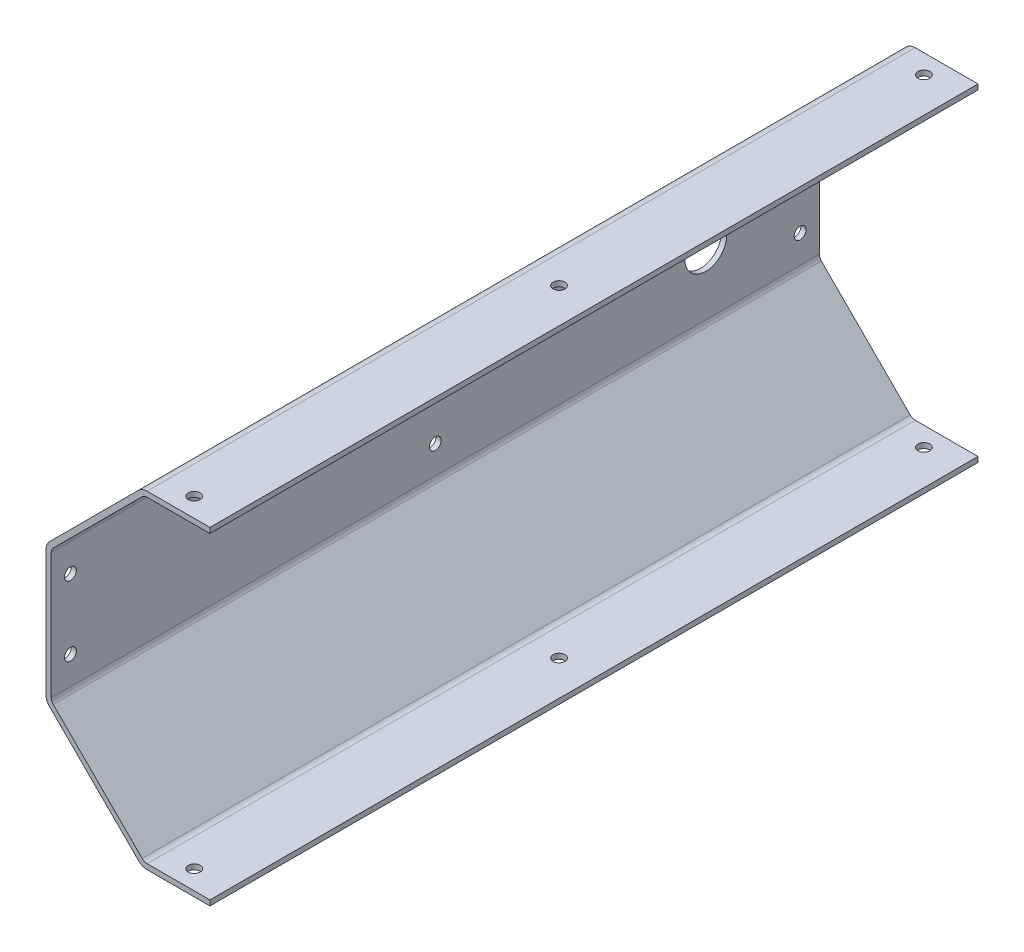
ISO-10303-21;
HEADER;
FILE_DESCRIPTION(('STEP AP214'),'2;1');
FILE_NAME('part.step','',(''),(''),'','','');
FILE_SCHEMA(('AUTOMOTIVE_DESIGN { 1 0 10303 214 1 1 1 1 }'));
ENDSEC;
DATA;
#1=APPLICATION_CONTEXT('core data for automotive mechanical design processes');
#2=APPLICATION_PROTOCOL_DEFINITION('international standard','automotive_design',2000,#1);
#3=PRODUCT_CONTEXT('',#1,'mechanical');
#4=PRODUCT('Part','Part','',(#3));
#5=PRODUCT_RELATED_PRODUCT_CATEGORY('part','',(#4));
#6=PRODUCT_DEFINITION_FORMATION('','',#4);
#7=PRODUCT_DEFINITION_CONTEXT('part definition',#1,'design');
#8=PRODUCT_DEFINITION('design','',#6,#7);
#9=PRODUCT_DEFINITION_SHAPE('','',#8);
#10=(LENGTH_UNIT() NAMED_UNIT(*) SI_UNIT(.MILLI.,.METRE.));
#11=(NAMED_UNIT(*) PLANE_ANGLE_UNIT() SI_UNIT($,.RADIAN.));
#12=(NAMED_UNIT(*) SI_UNIT($,.STERADIAN.) SOLID_ANGLE_UNIT());
#13=UNCERTAINTY_MEASURE_WITH_UNIT(LENGTH_MEASURE(1.E-05),#10,'distance_accuracy_value','');
#14=(GEOMETRIC_REPRESENTATION_CONTEXT(3) GLOBAL_UNCERTAINTY_ASSIGNED_CONTEXT((#13)) GLOBAL_UNIT_ASSIGNED_CONTEXT((#10,
#11,#12)) REPRESENTATION_CONTEXT('',''));
#15=CARTESIAN_POINT('',(0.,0.,0.));
#16=DIRECTION('',(0.,0.,1.));
#17=DIRECTION('',(1.,0.,0.));
#18=AXIS2_PLACEMENT_3D('',#15,#16,#17);
#19=CARTESIAN_POINT('',(-96.95,-17.9975792851109,-168.5));
#20=DIRECTION('',(1.,0.,0.));
#21=DIRECTION('',(0.,1.,0.));
#22=AXIS2_PLACEMENT_3D('',#19,#20,#21);
#23=PLANE('',#22);
#24=DIRECTION('',(0.,1.,0.));
#25=VECTOR('',#24,1.);
#26=CARTESIAN_POINT('',(-96.95,-17.9975792851109,51.5));
#27=LINE('',#26,#25);
#28=CARTESIAN_POINT('',(-96.95,-17.9975792851109,51.5));
#29=VERTEX_POINT('',#28);
#30=CARTESIAN_POINT('',(-96.95,17.9975792851113,51.5));
#31=VERTEX_POINT('',#30);
#32=EDGE_CURVE('E107',#29,#31,#27,.T.);
#33=ORIENTED_EDGE('',*,*,#32,.T.);
#34=DIRECTION('',(0.,0.,1.));
#35=VECTOR('',#34,1.);
#36=CARTESIAN_POINT('',(-96.95,17.9975792851113,-168.5));
#37=LINE('',#36,#35);
#38=CARTESIAN_POINT('',(-96.95,17.9975792851113,-168.5));
#39=VERTEX_POINT('',#38);
#40=EDGE_CURVE('E229',#39,#31,#37,.T.);
#41=ORIENTED_EDGE('',*,*,#40,.F.);
#42=DIRECTION('',(0.,1.,0.));
#43=VECTOR('',#42,1.);
#44=CARTESIAN_POINT('',(-96.95,-17.9975792851109,-168.5));
#45=LINE('',#44,#43);
#46=CARTESIAN_POINT('',(-96.95,-17.9975792851109,-168.5));
#47=VERTEX_POINT('',#46);
#48=EDGE_CURVE('E36',#47,#39,#45,.T.);
#49=ORIENTED_EDGE('',*,*,#48,.F.);
#50=DIRECTION('',(0.,0.,1.));
#51=VECTOR('',#50,1.);
#52=CARTESIAN_POINT('',(-96.95,-17.9975792851109,-168.5));
#53=LINE('',#52,#51);
#54=EDGE_CURVE('E180',#47,#29,#53,.T.);
#55=ORIENTED_EDGE('',*,*,#54,.T.);
#56=EDGE_LOOP('',(#33,#41,#49,#55));
#57=FACE_BOUND('',#56,.T.);
#58=CARTESIAN_POINT('',(-96.95,10.0000000000004,46.));
#59=DIRECTION('',(1.,0.,0.));
#60=DIRECTION('',(0.,-1.,0.));
#61=AXIS2_PLACEMENT_3D('',#58,#59,#60);
#62=CIRCLE('',#61,1.7);
#63=CARTESIAN_POINT('',(-96.95,8.30000000000044,46.));
#64=VERTEX_POINT('',#63);
#65=EDGE_CURVE('E297',#64,#64,#62,.T.);
#66=ORIENTED_EDGE('',*,*,#65,.T.);
#67=EDGE_LOOP('',(#66));
#68=FACE_BOUND('',#67,.T.);
#69=CARTESIAN_POINT('',(-96.95,10.0000000000004,-58.5));
#70=DIRECTION('',(1.,0.,0.));
#71=DIRECTION('',(0.,-1.,0.));
#72=AXIS2_PLACEMENT_3D('',#69,#70,#71);
#73=CIRCLE('',#72,1.7);
#74=CARTESIAN_POINT('',(-96.95,8.30000000000044,-58.5));
#75=VERTEX_POINT('',#74);
#76=EDGE_CURVE('E857',#75,#75,#73,.T.);
#77=ORIENTED_EDGE('',*,*,#76,.T.);
#78=EDGE_LOOP('',(#77));
#79=FACE_BOUND('',#78,.T.);
#80=CARTESIAN_POINT('',(-96.95,10.0000000000004,-163.));
#81=DIRECTION('',(1.,0.,0.));
#82=DIRECTION('',(0.,-1.,0.));
#83=AXIS2_PLACEMENT_3D('',#80,#81,#82);
#84=CIRCLE('',#83,1.7);
#85=CARTESIAN_POINT('',(-96.95,8.30000000000044,-163.));
#86=VERTEX_POINT('',#85);
#87=EDGE_CURVE('E851',#86,#86,#84,.T.);
#88=ORIENTED_EDGE('',*,*,#87,.T.);
#89=EDGE_LOOP('',(#88));
#90=FACE_BOUND('',#89,.T.);
#91=CARTESIAN_POINT('',(-96.95,-9.99999999999955,46.));
#92=DIRECTION('',(1.,0.,0.));
#93=DIRECTION('',(0.,-1.,0.));
#94=AXIS2_PLACEMENT_3D('',#91,#92,#93);
#95=CIRCLE('',#94,1.7);
#96=CARTESIAN_POINT('',(-96.95,-11.6999999999995,46.));
#97=VERTEX_POINT('',#96);
#98=EDGE_CURVE('E845',#97,#97,#95,.T.);
#99=ORIENTED_EDGE('',*,*,#98,.T.);
#100=EDGE_LOOP('',(#99));
#101=FACE_BOUND('',#100,.T.);
#102=CARTESIAN_POINT('',(-96.95,-9.99999999999955,-58.5));
#103=DIRECTION('',(1.,0.,0.));
#104=DIRECTION('',(0.,-1.,0.));
#105=AXIS2_PLACEMENT_3D('',#102,#103,#104);
#106=CIRCLE('',#105,1.7);
#107=CARTESIAN_POINT('',(-96.95,-11.6999999999995,-58.5));
#108=VERTEX_POINT('',#107);
#109=EDGE_CURVE('E840',#108,#108,#106,.T.);
#110=ORIENTED_EDGE('',*,*,#109,.T.);
#111=EDGE_LOOP('',(#110));
#112=FACE_BOUND('',#111,.T.);
#113=CARTESIAN_POINT('',(-96.95,-9.99999999999956,-163.));
#114=DIRECTION('',(1.,0.,0.));
#115=DIRECTION('',(0.,-1.,0.));
#116=AXIS2_PLACEMENT_3D('',#113,#114,#115);
#117=CIRCLE('',#116,1.7);
#118=CARTESIAN_POINT('',(-96.95,-11.6999999999996,-163.));
#119=VERTEX_POINT('',#118);
#120=EDGE_CURVE('E833',#119,#119,#117,.T.);
#121=ORIENTED_EDGE('',*,*,#120,.T.);
#122=EDGE_LOOP('',(#121));
#123=FACE_BOUND('',#122,.T.);
#124=CARTESIAN_POINT('',(-96.95,-4.67430235906452E-05,-135.980047718646));
#125=DIRECTION('',(-1.,0.,0.));
#126=DIRECTION('',(0.,1.,0.));
#127=AXIS2_PLACEMENT_3D('',#124,#125,#126);
#128=CIRCLE('',#127,6.);
#129=CARTESIAN_POINT('',(-96.95,5.99995325697641,-135.980047718646));
#130=VERTEX_POINT('',#129);
#131=EDGE_CURVE('E830',#130,#130,#128,.T.);
#132=ORIENTED_EDGE('',*,*,#131,.F.);
#133=EDGE_LOOP('',(#132));
#134=FACE_BOUND('',#133,.T.);
#135=ADVANCED_FACE('F17',(#57,#68,#79,#90,#101,#112,#123,#134),#23,.F.);
#136=CARTESIAN_POINT('',(-95.45,17.9975792851112,-168.5));
#137=DIRECTION('',(-1.,0.,0.));
#138=DIRECTION('',(0.,-1.,0.));
#139=AXIS2_PLACEMENT_3D('',#136,#137,#138);
#140=PLANE('',#139);
#141=CARTESIAN_POINT('',(-95.45,-4.67430235906452E-05,-135.980047718646));
#142=DIRECTION('',(-1.,0.,0.));
#143=DIRECTION('',(0.,-1.,0.));
#144=AXIS2_PLACEMENT_3D('',#141,#142,#143);
#145=CIRCLE('',#144,6.);
#146=CARTESIAN_POINT('',(-95.45,-6.00004674302359,-135.980047718646));
#147=VERTEX_POINT('',#146);
#148=EDGE_CURVE('E21',#147,#147,#145,.T.);
#149=ORIENTED_EDGE('',*,*,#148,.T.);
#150=EDGE_LOOP('',(#149));
#151=FACE_BOUND('',#150,.T.);
#152=CARTESIAN_POINT('',(-95.45,-9.99999999999955,-58.5));
#153=DIRECTION('',(1.,0.,0.));
#154=DIRECTION('',(0.,-1.,0.));
#155=AXIS2_PLACEMENT_3D('',#152,#153,#154);
#156=CIRCLE('',#155,1.7);
#157=CARTESIAN_POINT('',(-95.45,-11.6999999999995,-58.5));
#158=VERTEX_POINT('',#157);
#159=EDGE_CURVE('E842',#158,#158,#156,.T.);
#160=ORIENTED_EDGE('',*,*,#159,.F.);
#161=EDGE_LOOP('',(#160));
#162=FACE_BOUND('',#161,.T.);
#163=CARTESIAN_POINT('',(-95.45,10.0000000000004,-163.));
#164=DIRECTION('',(1.,0.,0.));
#165=DIRECTION('',(0.,-1.,0.));
#166=AXIS2_PLACEMENT_3D('',#163,#164,#165);
#167=CIRCLE('',#166,1.7);
#168=CARTESIAN_POINT('',(-95.45,8.30000000000044,-163.));
#169=VERTEX_POINT('',#168);
#170=EDGE_CURVE('E854',#169,#169,#167,.T.);
#171=ORIENTED_EDGE('',*,*,#170,.F.);
#172=EDGE_LOOP('',(#171));
#173=FACE_BOUND('',#172,.T.);
#174=CARTESIAN_POINT('',(-95.45,10.0000000000004,46.));
#175=DIRECTION('',(1.,0.,0.));
#176=DIRECTION('',(0.,-1.,0.));
#177=AXIS2_PLACEMENT_3D('',#174,#175,#176);
#178=CIRCLE('',#177,1.7);
#179=CARTESIAN_POINT('',(-95.45,8.30000000000044,46.));
#180=VERTEX_POINT('',#179);
#181=EDGE_CURVE('E292',#180,#180,#178,.T.);
#182=ORIENTED_EDGE('',*,*,#181,.F.);
#183=EDGE_LOOP('',(#182));
#184=FACE_BOUND('',#183,.T.);
#185=DIRECTION('',(0.,-1.,0.));
#186=VECTOR('',#185,1.);
#187=CARTESIAN_POINT('',(-95.45,17.9975792851112,51.5));
#188=LINE('',#187,#186);
#189=CARTESIAN_POINT('',(-95.45,17.9975792851113,51.5));
#190=VERTEX_POINT('',#189);
#191=CARTESIAN_POINT('',(-95.45,-17.9975792851109,51.5));
#192=VERTEX_POINT('',#191);
#193=EDGE_CURVE('E207',#190,#192,#188,.T.);
#194=ORIENTED_EDGE('',*,*,#193,.T.);
#195=DIRECTION('',(0.,0.,1.));
#196=VECTOR('',#195,1.);
#197=CARTESIAN_POINT('',(-95.45,-17.9975792851109,-168.5));
#198=LINE('',#197,#196);
#199=CARTESIAN_POINT('',(-95.45,-17.9975792851109,-168.5));
#200=VERTEX_POINT('',#199);
#201=EDGE_CURVE('E251',#200,#192,#198,.T.);
#202=ORIENTED_EDGE('',*,*,#201,.F.);
#203=DIRECTION('',(0.,-1.,0.));
#204=VECTOR('',#203,1.);
#205=CARTESIAN_POINT('',(-95.45,17.9975792851112,-168.5));
#206=LINE('',#205,#204);
#207=CARTESIAN_POINT('',(-95.45,17.9975792851113,-168.5));
#208=VERTEX_POINT('',#207);
#209=EDGE_CURVE('E334',#208,#200,#206,.T.);
#210=ORIENTED_EDGE('',*,*,#209,.F.);
#211=DIRECTION('',(0.,0.,1.));
#212=VECTOR('',#211,1.);
#213=CARTESIAN_POINT('',(-95.45,17.9975792851113,-168.5));
#214=LINE('',#213,#212);
#215=EDGE_CURVE('E254',#208,#190,#214,.T.);
#216=ORIENTED_EDGE('',*,*,#215,.T.);
#217=EDGE_LOOP('',(#194,#202,#210,#216));
#218=FACE_BOUND('',#217,.T.);
#219=CARTESIAN_POINT('',(-95.45,10.0000000000004,-58.5));
#220=DIRECTION('',(1.,0.,0.));
#221=DIRECTION('',(0.,-1.,0.));
#222=AXIS2_PLACEMENT_3D('',#219,#220,#221);
#223=CIRCLE('',#222,1.7);
#224=CARTESIAN_POINT('',(-95.45,8.30000000000044,-58.5));
#225=VERTEX_POINT('',#224);
#226=EDGE_CURVE('E860',#225,#225,#223,.T.);
#227=ORIENTED_EDGE('',*,*,#226,.F.);
#228=EDGE_LOOP('',(#227));
#229=FACE_BOUND('',#228,.T.);
#230=CARTESIAN_POINT('',(-95.45,-9.99999999999955,46.));
#231=DIRECTION('',(1.,0.,0.));
#232=DIRECTION('',(0.,-1.,0.));
#233=AXIS2_PLACEMENT_3D('',#230,#231,#232);
#234=CIRCLE('',#233,1.7);
#235=CARTESIAN_POINT('',(-95.45,-11.6999999999995,46.));
#236=VERTEX_POINT('',#235);
#237=EDGE_CURVE('E848',#236,#236,#234,.T.);
#238=ORIENTED_EDGE('',*,*,#237,.F.);
#239=EDGE_LOOP('',(#238));
#240=FACE_BOUND('',#239,.T.);
#241=CARTESIAN_POINT('',(-95.45,-9.99999999999956,-163.));
#242=DIRECTION('',(1.,0.,0.));
#243=DIRECTION('',(0.,-1.,0.));
#244=AXIS2_PLACEMENT_3D('',#241,#242,#243);
#245=CIRCLE('',#244,1.7);
#246=CARTESIAN_POINT('',(-95.45,-11.6999999999996,-163.));
#247=VERTEX_POINT('',#246);
#248=EDGE_CURVE('E835',#247,#247,#245,.T.);
#249=ORIENTED_EDGE('',*,*,#248,.F.);
#250=EDGE_LOOP('',(#249));
#251=FACE_BOUND('',#250,.T.);
#252=ADVANCED_FACE('F403',(#151,#162,#173,#184,#218,#229,#240,#251),#140,.F.);
#253=CARTESIAN_POINT('',(-95.9248737341529,20.4724530192641,-168.5));
#254=DIRECTION('',(0.707106781186543,-0.707106781186553,0.));
#255=DIRECTION('',(0.707106781186553,0.707106781186543,0.));
#256=AXIS2_PLACEMENT_3D('',#253,#254,#255);
#257=PLANE('',#256);
#258=DIRECTION('',(0.707106781186553,0.707106781186543,0.));
#259=VECTOR('',#258,1.);
#260=CARTESIAN_POINT('',(-95.9248737341529,20.4724530192641,51.5));
#261=LINE('',#260,#259);
#262=CARTESIAN_POINT('',(-95.9248737341529,20.4724530192641,51.5));
#263=VERTEX_POINT('',#262);
#264=CARTESIAN_POINT('',(-70.4724530192636,45.9248737341531,51.5));
#265=VERTEX_POINT('',#264);
#266=EDGE_CURVE('E189',#263,#265,#261,.T.);
#267=ORIENTED_EDGE('',*,*,#266,.T.);
#268=DIRECTION('',(0.,0.,1.));
#269=VECTOR('',#268,1.);
#270=CARTESIAN_POINT('',(-70.4724530192636,45.9248737341531,-168.5));
#271=LINE('',#270,#269);
#272=CARTESIAN_POINT('',(-70.4724530192636,45.9248737341531,-168.5));
#273=VERTEX_POINT('',#272);
#274=EDGE_CURVE('E11',#273,#265,#271,.T.);
#275=ORIENTED_EDGE('',*,*,#274,.F.);
#276=DIRECTION('',(0.707106781186553,0.707106781186543,0.));
#277=VECTOR('',#276,1.);
#278=CARTESIAN_POINT('',(-95.9248737341529,20.4724530192641,-168.5));
#279=LINE('',#278,#277);
#280=CARTESIAN_POINT('',(-95.9248737341529,20.4724530192641,-168.5));
#281=VERTEX_POINT('',#280);
#282=EDGE_CURVE('E228',#281,#273,#279,.T.);
#283=ORIENTED_EDGE('',*,*,#282,.F.);
#284=DIRECTION('',(0.,0.,1.));
#285=VECTOR('',#284,1.);
#286=CARTESIAN_POINT('',(-95.9248737341529,20.4724530192641,-168.5));
#287=LINE('',#286,#285);
#288=EDGE_CURVE('E188',#281,#263,#287,.T.);
#289=ORIENTED_EDGE('',*,*,#288,.T.);
#290=EDGE_LOOP('',(#267,#275,#283,#289));
#291=FACE_BOUND('',#290,.T.);
#292=ADVANCED_FACE('F19',(#291),#257,.F.);
#293=CARTESIAN_POINT('',(-67.9975792851107,43.45,-168.5));
#294=DIRECTION('',(0.,0.,1.));
#295=DIRECTION('',(1.,0.,0.));
#296=AXIS2_PLACEMENT_3D('',#293,#294,#295);
#297=CYLINDRICAL_SURFACE('',#296,3.5);
#298=CARTESIAN_POINT('',(-67.9975792851107,43.45,51.5));
#299=DIRECTION('',(0.,0.,-1.));
#300=DIRECTION('',(1.,0.,0.));
#301=AXIS2_PLACEMENT_3D('',#298,#299,#300);
#302=CIRCLE('',#301,3.5);
#303=CARTESIAN_POINT('',(-67.9975792851107,46.95,51.5));
#304=VERTEX_POINT('',#303);
#305=EDGE_CURVE('E192',#265,#304,#302,.T.);
#306=ORIENTED_EDGE('',*,*,#305,.T.);
#307=DIRECTION('',(0.,0.,1.));
#308=VECTOR('',#307,1.);
#309=CARTESIAN_POINT('',(-67.9975792851107,46.95,-168.5));
#310=LINE('',#309,#308);
#311=CARTESIAN_POINT('',(-67.9975792851107,46.95,-168.5));
#312=VERTEX_POINT('',#311);
#313=EDGE_CURVE('E27',#312,#304,#310,.T.);
#314=ORIENTED_EDGE('',*,*,#313,.F.);
#315=CARTESIAN_POINT('',(-67.9975792851107,43.45,-168.5));
#316=DIRECTION('',(0.,0.,-1.));
#317=DIRECTION('',(1.,0.,0.));
#318=AXIS2_PLACEMENT_3D('',#315,#316,#317);
#319=CIRCLE('',#318,3.5);
#320=EDGE_CURVE('E320',#273,#312,#319,.T.);
#321=ORIENTED_EDGE('',*,*,#320,.F.);
#322=ORIENTED_EDGE('',*,*,#274,.T.);
#323=EDGE_LOOP('',(#306,#314,#321,#322));
#324=FACE_BOUND('',#323,.T.);
#325=ADVANCED_FACE('F370',(#324),#297,.T.);
#326=CARTESIAN_POINT('',(-67.9975792851107,46.95,-168.5));
#327=DIRECTION('',(0.,-1.,0.));
#328=DIRECTION('',(1.,0.,0.));
#329=AXIS2_PLACEMENT_3D('',#326,#327,#328);
#330=PLANE('',#329);
#331=CARTESIAN_POINT('',(-59.9999999999969,46.95,46.));
#332=DIRECTION('',(0.,-1.,0.));
#333=DIRECTION('',(1.,0.,0.));
#334=AXIS2_PLACEMENT_3D('',#331,#332,#333);
#335=CIRCLE('',#334,1.7);
#336=CARTESIAN_POINT('',(-58.2999999999969,46.95,46.));
#337=VERTEX_POINT('',#336);
#338=EDGE_CURVE('E286',#337,#337,#335,.T.);
#339=ORIENTED_EDGE('',*,*,#338,.T.);
#340=EDGE_LOOP('',(#339));
#341=FACE_BOUND('',#340,.T.);
#342=CARTESIAN_POINT('',(-59.9999999999968,46.95,-58.5));
#343=DIRECTION('',(0.,-1.,0.));
#344=DIRECTION('',(1.,0.,0.));
#345=AXIS2_PLACEMENT_3D('',#342,#343,#344);
#346=CIRCLE('',#345,1.7);
#347=CARTESIAN_POINT('',(-58.2999999999968,46.95,-58.5));
#348=VERTEX_POINT('',#347);
#349=EDGE_CURVE('E283',#348,#348,#346,.T.);
#350=ORIENTED_EDGE('',*,*,#349,.T.);
#351=EDGE_LOOP('',(#350));
#352=FACE_BOUND('',#351,.T.);
#353=CARTESIAN_POINT('',(-59.9999999999969,46.95,-163.));
#354=DIRECTION('',(0.,-1.,0.));
#355=DIRECTION('',(1.,0.,0.));
#356=AXIS2_PLACEMENT_3D('',#353,#354,#355);
#357=CIRCLE('',#356,1.7);
#358=CARTESIAN_POINT('',(-58.2999999999969,46.95,-163.));
#359=VERTEX_POINT('',#358);
#360=EDGE_CURVE('E280',#359,#359,#357,.T.);
#361=ORIENTED_EDGE('',*,*,#360,.T.);
#362=EDGE_LOOP('',(#361));
#363=FACE_BOUND('',#362,.T.);
#364=DIRECTION('',(1.,0.,0.));
#365=VECTOR('',#364,1.);
#366=CARTESIAN_POINT('',(-67.9975792851107,46.95,51.5));
#367=LINE('',#366,#365);
#368=CARTESIAN_POINT('',(-50.,46.95,51.5));
#369=VERTEX_POINT('',#368);
#370=EDGE_CURVE('E195',#304,#369,#367,.T.);
#371=ORIENTED_EDGE('',*,*,#370,.T.);
#372=DIRECTION('',(0.,0.,1.));
#373=VECTOR('',#372,1.);
#374=CARTESIAN_POINT('',(-50.,46.95,-168.5));
#375=LINE('',#374,#373);
#376=CARTESIAN_POINT('',(-50.,46.95,-168.5));
#377=VERTEX_POINT('',#376);
#378=EDGE_CURVE('E269',#377,#369,#375,.T.);
#379=ORIENTED_EDGE('',*,*,#378,.F.);
#380=DIRECTION('',(1.,0.,0.));
#381=VECTOR('',#380,1.);
#382=CARTESIAN_POINT('',(-67.9975792851107,46.95,-168.5));
#383=LINE('',#382,#381);
#384=EDGE_CURVE('E322',#312,#377,#383,.T.);
#385=ORIENTED_EDGE('',*,*,#384,.F.);
#386=ORIENTED_EDGE('',*,*,#313,.T.);
#387=EDGE_LOOP('',(#371,#379,#385,#386));
#388=FACE_BOUND('',#387,.T.);
#389=ADVANCED_FACE('F373',(#341,#352,#363,#388),#330,.F.);
#390=CARTESIAN_POINT('',(-50.,46.95,-168.5));
#391=DIRECTION('',(-1.,0.,0.));
#392=DIRECTION('',(0.,0.,1.));
#393=AXIS2_PLACEMENT_3D('',#390,#391,#392);
#394=PLANE('',#393);
#395=DIRECTION('',(0.,-1.,0.));
#396=VECTOR('',#395,1.);
#397=CARTESIAN_POINT('',(-50.,46.95,51.5));
#398=LINE('',#397,#396);
#399=CARTESIAN_POINT('',(-50.,45.45,51.5));
#400=VERTEX_POINT('',#399);
#401=EDGE_CURVE('E197',#369,#400,#398,.T.);
#402=ORIENTED_EDGE('',*,*,#401,.T.);
#403=DIRECTION('',(0.,0.,1.));
#404=VECTOR('',#403,1.);
#405=CARTESIAN_POINT('',(-50.,45.45,-168.5));
#406=LINE('',#405,#404);
#407=CARTESIAN_POINT('',(-50.,45.45,-168.5));
#408=VERTEX_POINT('',#407);
#409=EDGE_CURVE('E266',#408,#400,#406,.T.);
#410=ORIENTED_EDGE('',*,*,#409,.F.);
#411=DIRECTION('',(0.,-1.,0.));
#412=VECTOR('',#411,1.);
#413=CARTESIAN_POINT('',(-50.,46.95,-168.5));
#414=LINE('',#413,#412);
#415=EDGE_CURVE('E324',#377,#408,#414,.T.);
#416=ORIENTED_EDGE('',*,*,#415,.F.);
#417=ORIENTED_EDGE('',*,*,#378,.T.);
#418=EDGE_LOOP('',(#402,#410,#416,#417));
#419=FACE_BOUND('',#418,.T.);
#420=ADVANCED_FACE('F378',(#419),#394,.F.);
#421=CARTESIAN_POINT('',(-50.,45.45,-168.5));
#422=DIRECTION('',(0.,1.,0.));
#423=DIRECTION('',(-1.,0.,0.));
#424=AXIS2_PLACEMENT_3D('',#421,#422,#423);
#425=PLANE('',#424);
#426=CARTESIAN_POINT('',(-59.9999999999969,45.45,46.));
#427=DIRECTION('',(0.,1.,0.));
#428=DIRECTION('',(-1.,0.,0.));
#429=AXIS2_PLACEMENT_3D('',#426,#427,#428);
#430=CIRCLE('',#429,1.7);
#431=CARTESIAN_POINT('',(-61.6999999999969,45.45,46.));
#432=VERTEX_POINT('',#431);
#433=EDGE_CURVE('E284',#432,#432,#430,.T.);
#434=ORIENTED_EDGE('',*,*,#433,.T.);
#435=EDGE_LOOP('',(#434));
#436=FACE_BOUND('',#435,.T.);
#437=CARTESIAN_POINT('',(-59.9999999999969,45.45,-58.5));
#438=DIRECTION('',(0.,1.,0.));
#439=DIRECTION('',(-1.,0.,0.));
#440=AXIS2_PLACEMENT_3D('',#437,#438,#439);
#441=CIRCLE('',#440,1.7);
#442=CARTESIAN_POINT('',(-61.6999999999969,45.45,-58.5));
#443=VERTEX_POINT('',#442);
#444=EDGE_CURVE('E281',#443,#443,#441,.T.);
#445=ORIENTED_EDGE('',*,*,#444,.T.);
#446=EDGE_LOOP('',(#445));
#447=FACE_BOUND('',#446,.T.);
#448=CARTESIAN_POINT('',(-59.9999999999969,45.45,-163.));
#449=DIRECTION('',(0.,1.,0.));
#450=DIRECTION('',(-1.,0.,0.));
#451=AXIS2_PLACEMENT_3D('',#448,#449,#450);
#452=CIRCLE('',#451,1.7);
#453=CARTESIAN_POINT('',(-61.6999999999969,45.45,-163.));
#454=VERTEX_POINT('',#453);
#455=EDGE_CURVE('E276',#454,#454,#452,.T.);
#456=ORIENTED_EDGE('',*,*,#455,.T.);
#457=EDGE_LOOP('',(#456));
#458=FACE_BOUND('',#457,.T.);
#459=DIRECTION('',(-1.,0.,0.));
#460=VECTOR('',#459,1.);
#461=CARTESIAN_POINT('',(-50.,45.45,51.5));
#462=LINE('',#461,#460);
#463=CARTESIAN_POINT('',(-67.9975792851107,45.45,51.5));
#464=VERTEX_POINT('',#463);
#465=EDGE_CURVE('E199',#400,#464,#462,.T.);
#466=ORIENTED_EDGE('',*,*,#465,.T.);
#467=DIRECTION('',(0.,0.,1.));
#468=VECTOR('',#467,1.);
#469=CARTESIAN_POINT('',(-67.9975792851107,45.45,-168.5));
#470=LINE('',#469,#468);
#471=CARTESIAN_POINT('',(-67.9975792851107,45.45,-168.5));
#472=VERTEX_POINT('',#471);
#473=EDGE_CURVE('E263',#472,#464,#470,.T.);
#474=ORIENTED_EDGE('',*,*,#473,.F.);
#475=DIRECTION('',(-1.,0.,0.));
#476=VECTOR('',#475,1.);
#477=CARTESIAN_POINT('',(-50.,45.45,-168.5));
#478=LINE('',#477,#476);
#479=EDGE_CURVE('E326',#408,#472,#478,.T.);
#480=ORIENTED_EDGE('',*,*,#479,.F.);
#481=ORIENTED_EDGE('',*,*,#409,.T.);
#482=EDGE_LOOP('',(#466,#474,#480,#481));
#483=FACE_BOUND('',#482,.T.);
#484=ADVANCED_FACE('F384',(#436,#447,#458,#483),#425,.F.);
#485=CARTESIAN_POINT('',(-67.9975792851107,43.45,-168.5));
#486=DIRECTION('',(0.,0.,1.));
#487=DIRECTION('',(1.,0.,0.));
#488=AXIS2_PLACEMENT_3D('',#485,#486,#487);
#489=CYLINDRICAL_SURFACE('',#488,2.);
#490=CARTESIAN_POINT('',(-67.9975792851107,43.45,51.5));
#491=DIRECTION('',(0.,0.,1.));
#492=DIRECTION('',(1.,0.,0.));
#493=AXIS2_PLACEMENT_3D('',#490,#491,#492);
#494=CIRCLE('',#493,2.);
#495=CARTESIAN_POINT('',(-69.4117928474838,44.8642135623733,51.5));
#496=VERTEX_POINT('',#495);
#497=EDGE_CURVE('E201',#464,#496,#494,.T.);
#498=ORIENTED_EDGE('',*,*,#497,.T.);
#499=DIRECTION('',(0.,0.,1.));
#500=VECTOR('',#499,1.);
#501=CARTESIAN_POINT('',(-69.4117928474838,44.8642135623733,-168.5));
#502=LINE('',#501,#500);
#503=CARTESIAN_POINT('',(-69.4117928474838,44.8642135623733,-168.5));
#504=VERTEX_POINT('',#503);
#505=EDGE_CURVE('E260',#504,#496,#502,.T.);
#506=ORIENTED_EDGE('',*,*,#505,.F.);
#507=CARTESIAN_POINT('',(-67.9975792851107,43.45,-168.5));
#508=DIRECTION('',(0.,0.,1.));
#509=DIRECTION('',(1.,0.,0.));
#510=AXIS2_PLACEMENT_3D('',#507,#508,#509);
#511=CIRCLE('',#510,2.);
#512=EDGE_CURVE('E328',#472,#504,#511,.T.);
#513=ORIENTED_EDGE('',*,*,#512,.F.);
#514=ORIENTED_EDGE('',*,*,#473,.T.);
#515=EDGE_LOOP('',(#498,#506,#513,#514));
#516=FACE_BOUND('',#515,.T.);
#517=ADVANCED_FACE('F388',(#516),#489,.F.);
#518=CARTESIAN_POINT('',(-69.4117928474838,44.8642135623733,-168.5));
#519=DIRECTION('',(-0.707106781186543,0.707106781186553,0.));
#520=DIRECTION('',(-0.707106781186553,-0.707106781186543,0.));
#521=AXIS2_PLACEMENT_3D('',#518,#519,#520);
#522=PLANE('',#521);
#523=DIRECTION('',(-0.707106781186553,-0.707106781186543,0.));
#524=VECTOR('',#523,1.);
#525=CARTESIAN_POINT('',(-69.4117928474838,44.8642135623733,51.5));
#526=LINE('',#525,#524);
#527=CARTESIAN_POINT('',(-94.864213562373,19.4117928474843,51.5));
#528=VERTEX_POINT('',#527);
#529=EDGE_CURVE('E203',#496,#528,#526,.T.);
#530=ORIENTED_EDGE('',*,*,#529,.T.);
#531=DIRECTION('',(0.,0.,1.));
#532=VECTOR('',#531,1.);
#533=CARTESIAN_POINT('',(-94.864213562373,19.4117928474843,-168.5));
#534=LINE('',#533,#532);
#535=CARTESIAN_POINT('',(-94.864213562373,19.4117928474843,-168.5));
#536=VERTEX_POINT('',#535);
#537=EDGE_CURVE('E257',#536,#528,#534,.T.);
#538=ORIENTED_EDGE('',*,*,#537,.F.);
#539=DIRECTION('',(-0.707106781186553,-0.707106781186543,0.));
#540=VECTOR('',#539,1.);
#541=CARTESIAN_POINT('',(-69.4117928474838,44.8642135623733,-168.5));
#542=LINE('',#541,#540);
#543=EDGE_CURVE('E330',#504,#536,#542,.T.);
#544=ORIENTED_EDGE('',*,*,#543,.F.);
#545=ORIENTED_EDGE('',*,*,#505,.T.);
#546=EDGE_LOOP('',(#530,#538,#544,#545));
#547=FACE_BOUND('',#546,.T.);
#548=ADVANCED_FACE('F393',(#547),#522,.F.);
#549=CARTESIAN_POINT('',(-93.45,17.9975792851112,-168.5));
#550=DIRECTION('',(0.,0.,1.));
#551=DIRECTION('',(1.,0.,0.));
#552=AXIS2_PLACEMENT_3D('',#549,#550,#551);
#553=CYLINDRICAL_SURFACE('',#552,2.);
#554=CARTESIAN_POINT('',(-93.45,17.9975792851112,51.5));
#555=DIRECTION('',(0.,0.,1.));
#556=DIRECTION('',(1.,0.,0.));
#557=AXIS2_PLACEMENT_3D('',#554,#555,#556);
#558=CIRCLE('',#557,2.);
#559=EDGE_CURVE('E205',#528,#190,#558,.T.);
#560=ORIENTED_EDGE('',*,*,#559,.T.);
#561=ORIENTED_EDGE('',*,*,#215,.F.);
#562=CARTESIAN_POINT('',(-93.45,17.9975792851112,-168.5));
#563=DIRECTION('',(0.,0.,1.));
#564=DIRECTION('',(1.,0.,0.));
#565=AXIS2_PLACEMENT_3D('',#562,#563,#564);
#566=CIRCLE('',#565,2.);
#567=EDGE_CURVE('E332',#536,#208,#566,.T.);
#568=ORIENTED_EDGE('',*,*,#567,.F.);
#569=ORIENTED_EDGE('',*,*,#537,.T.);
#570=EDGE_LOOP('',(#560,#561,#568,#569));
#571=FACE_BOUND('',#570,.T.);
#572=ADVANCED_FACE('F399',(#571),#553,.F.);
#573=CARTESIAN_POINT('',(-93.45,-17.9975792851109,-168.5));
#574=DIRECTION('',(0.,0.,1.));
#575=DIRECTION('',(1.,0.,0.));
#576=AXIS2_PLACEMENT_3D('',#573,#574,#575);
#577=CYLINDRICAL_SURFACE('',#576,2.);
#578=CARTESIAN_POINT('',(-93.45,-17.9975792851109,51.5));
#579=DIRECTION('',(0.,0.,1.));
#580=DIRECTION('',(1.,0.,0.));
#581=AXIS2_PLACEMENT_3D('',#578,#579,#580);
#582=CIRCLE('',#581,2.);
#583=CARTESIAN_POINT('',(-94.8642135623731,-19.411792847484,51.5));
#584=VERTEX_POINT('',#583);
#585=EDGE_CURVE('E209',#192,#584,#582,.T.);
#586=ORIENTED_EDGE('',*,*,#585,.T.);
#587=DIRECTION('',(0.,0.,1.));
#588=VECTOR('',#587,1.);
#589=CARTESIAN_POINT('',(-94.8642135623731,-19.411792847484,-168.5));
#590=LINE('',#589,#588);
#591=CARTESIAN_POINT('',(-94.8642135623731,-19.411792847484,-168.5));
#592=VERTEX_POINT('',#591);
#593=EDGE_CURVE('E248',#592,#584,#590,.T.);
#594=ORIENTED_EDGE('',*,*,#593,.F.);
#595=CARTESIAN_POINT('',(-93.45,-17.9975792851109,-168.5));
#596=DIRECTION('',(0.,0.,1.));
#597=DIRECTION('',(1.,0.,0.));
#598=AXIS2_PLACEMENT_3D('',#595,#596,#597);
#599=CIRCLE('',#598,2.);
#600=EDGE_CURVE('E336',#200,#592,#599,.T.);
#601=ORIENTED_EDGE('',*,*,#600,.F.);
#602=ORIENTED_EDGE('',*,*,#201,.T.);
#603=EDGE_LOOP('',(#586,#594,#601,#602));
#604=FACE_BOUND('',#603,.T.);
#605=ADVANCED_FACE('F409',(#604),#577,.F.);
#606=CARTESIAN_POINT('',(-94.8642135623732,-19.411792847484,-168.5));
#607=DIRECTION('',(-0.707106781186549,-0.707106781186546,0.));
#608=DIRECTION('',(0.707106781186546,-0.707106781186549,0.));
#609=AXIS2_PLACEMENT_3D('',#606,#607,#608);
#610=PLANE('',#609);
#611=DIRECTION('',(0.707106781186546,-0.707106781186549,0.));
#612=VECTOR('',#611,1.);
#613=CARTESIAN_POINT('',(-94.8642135623732,-19.411792847484,51.5));
#614=LINE('',#613,#612);
#615=CARTESIAN_POINT('',(-69.4117928474842,-44.8642135623731,51.5));
#616=VERTEX_POINT('',#615);
#617=EDGE_CURVE('E211',#584,#616,#614,.T.);
#618=ORIENTED_EDGE('',*,*,#617,.T.);
#619=DIRECTION('',(0.,0.,1.));
#620=VECTOR('',#619,1.);
#621=CARTESIAN_POINT('',(-69.4117928474842,-44.8642135623731,-168.5));
#622=LINE('',#621,#620);
#623=CARTESIAN_POINT('',(-69.4117928474842,-44.8642135623731,-168.5));
#624=VERTEX_POINT('',#623);
#625=EDGE_CURVE('E245',#624,#616,#622,.T.);
#626=ORIENTED_EDGE('',*,*,#625,.F.);
#627=DIRECTION('',(0.707106781186546,-0.707106781186549,0.));
#628=VECTOR('',#627,1.);
#629=CARTESIAN_POINT('',(-94.8642135623732,-19.411792847484,-168.5));
#630=LINE('',#629,#628);
#631=EDGE_CURVE('E338',#592,#624,#630,.T.);
#632=ORIENTED_EDGE('',*,*,#631,.F.);
#633=ORIENTED_EDGE('',*,*,#593,.T.);
#634=EDGE_LOOP('',(#618,#626,#632,#633));
#635=FACE_BOUND('',#634,.T.);
#636=ADVANCED_FACE('F415',(#635),#610,.F.);
#637=CARTESIAN_POINT('',(-67.9975792851111,-43.45,-168.5));
#638=DIRECTION('',(0.,0.,1.));
#639=DIRECTION('',(1.,0.,0.));
#640=AXIS2_PLACEMENT_3D('',#637,#638,#639);
#641=CYLINDRICAL_SURFACE('',#640,2.);
#642=CARTESIAN_POINT('',(-67.9975792851111,-43.45,51.5));
#643=DIRECTION('',(0.,0.,1.));
#644=DIRECTION('',(1.,0.,0.));
#645=AXIS2_PLACEMENT_3D('',#642,#643,#644);
#646=CIRCLE('',#645,2.);
#647=CARTESIAN_POINT('',(-67.9975792851112,-45.45,51.5));
#648=VERTEX_POINT('',#647);
#649=EDGE_CURVE('E213',#616,#648,#646,.T.);
#650=ORIENTED_EDGE('',*,*,#649,.T.);
#651=DIRECTION('',(0.,0.,1.));
#652=VECTOR('',#651,1.);
#653=CARTESIAN_POINT('',(-67.9975792851112,-45.45,-168.5));
#654=LINE('',#653,#652);
#655=CARTESIAN_POINT('',(-67.9975792851112,-45.45,-168.5));
#656=VERTEX_POINT('',#655);
#657=EDGE_CURVE('E242',#656,#648,#654,.T.);
#658=ORIENTED_EDGE('',*,*,#657,.F.);
#659=CARTESIAN_POINT('',(-67.9975792851111,-43.45,-168.5));
#660=DIRECTION('',(0.,0.,1.));
#661=DIRECTION('',(1.,0.,0.));
#662=AXIS2_PLACEMENT_3D('',#659,#660,#661);
#663=CIRCLE('',#662,2.);
#664=EDGE_CURVE('E340',#624,#656,#663,.T.);
#665=ORIENTED_EDGE('',*,*,#664,.F.);
#666=ORIENTED_EDGE('',*,*,#625,.T.);
#667=EDGE_LOOP('',(#650,#658,#665,#666));
#668=FACE_BOUND('',#667,.T.);
#669=ADVANCED_FACE('F419',(#668),#641,.F.);
#670=CARTESIAN_POINT('',(-67.9975792851112,-45.45,-168.5));
#671=DIRECTION('',(0.,-1.,0.));
#672=DIRECTION('',(1.,0.,0.));
#673=AXIS2_PLACEMENT_3D('',#670,#671,#672);
#674=PLANE('',#673);
#675=CARTESIAN_POINT('',(-60.,-45.45,-163.));
#676=DIRECTION('',(0.,-1.,0.));
#677=DIRECTION('',(1.,0.,0.));
#678=AXIS2_PLACEMENT_3D('',#675,#676,#677);
#679=CIRCLE('',#678,1.7);
#680=CARTESIAN_POINT('',(-58.3,-45.45,-163.));
#681=VERTEX_POINT('',#680);
#682=EDGE_CURVE('E305',#681,#681,#679,.T.);
#683=ORIENTED_EDGE('',*,*,#682,.T.);
#684=EDGE_LOOP('',(#683));
#685=FACE_BOUND('',#684,.T.);
#686=CARTESIAN_POINT('',(-60.,-45.45,-58.5));
#687=DIRECTION('',(0.,-1.,0.));
#688=DIRECTION('',(1.,0.,0.));
#689=AXIS2_PLACEMENT_3D('',#686,#687,#688);
#690=CIRCLE('',#689,1.7);
#691=CARTESIAN_POINT('',(-58.3,-45.45,-58.5));
#692=VERTEX_POINT('',#691);
#693=EDGE_CURVE('E311',#692,#692,#690,.T.);
#694=ORIENTED_EDGE('',*,*,#693,.T.);
#695=EDGE_LOOP('',(#694));
#696=FACE_BOUND('',#695,.T.);
#697=CARTESIAN_POINT('',(-60.,-45.45,46.));
#698=DIRECTION('',(0.,-1.,0.));
#699=DIRECTION('',(1.,0.,0.));
#700=AXIS2_PLACEMENT_3D('',#697,#698,#699);
#701=CIRCLE('',#700,1.7);
#702=CARTESIAN_POINT('',(-58.3,-45.45,46.));
#703=VERTEX_POINT('',#702);
#704=EDGE_CURVE('E193',#703,#703,#701,.T.);
#705=ORIENTED_EDGE('',*,*,#704,.T.);
#706=EDGE_LOOP('',(#705));
#707=FACE_BOUND('',#706,.T.);
#708=DIRECTION('',(1.,0.,0.));
#709=VECTOR('',#708,1.);
#710=CARTESIAN_POINT('',(-67.9975792851112,-45.45,51.5));
#711=LINE('',#710,#709);
#712=CARTESIAN_POINT('',(-50.,-45.45,51.5));
#713=VERTEX_POINT('',#712);
#714=EDGE_CURVE('E215',#648,#713,#711,.T.);
#715=ORIENTED_EDGE('',*,*,#714,.T.);
#716=DIRECTION('',(0.,0.,1.));
#717=VECTOR('',#716,1.);
#718=CARTESIAN_POINT('',(-50.,-45.45,-168.5));
#719=LINE('',#718,#717);
#720=CARTESIAN_POINT('',(-50.,-45.45,-168.5));
#721=VERTEX_POINT('',#720);
#722=EDGE_CURVE('E239',#721,#713,#719,.T.);
#723=ORIENTED_EDGE('',*,*,#722,.F.);
#724=DIRECTION('',(1.,0.,0.));
#725=VECTOR('',#724,1.);
#726=CARTESIAN_POINT('',(-67.9975792851112,-45.45,-168.5));
#727=LINE('',#726,#725);
#728=EDGE_CURVE('E342',#656,#721,#727,.T.);
#729=ORIENTED_EDGE('',*,*,#728,.F.);
#730=ORIENTED_EDGE('',*,*,#657,.T.);
#731=EDGE_LOOP('',(#715,#723,#729,#730));
#732=FACE_BOUND('',#731,.T.);
#733=ADVANCED_FACE('F424',(#685,#696,#707,#732),#674,.F.);
#734=CARTESIAN_POINT('',(-50.,-45.45,-168.5));
#735=DIRECTION('',(-1.,0.,0.));
#736=DIRECTION('',(0.,0.,1.));
#737=AXIS2_PLACEMENT_3D('',#734,#735,#736);
#738=PLANE('',#737);
#739=DIRECTION('',(0.,-1.,0.));
#740=VECTOR('',#739,1.);
#741=CARTESIAN_POINT('',(-50.,-45.45,51.5));
#742=LINE('',#741,#740);
#743=CARTESIAN_POINT('',(-50.,-46.95,51.5));
#744=VERTEX_POINT('',#743);
#745=EDGE_CURVE('E217',#713,#744,#742,.T.);
#746=ORIENTED_EDGE('',*,*,#745,.T.);
#747=DIRECTION('',(0.,0.,1.));
#748=VECTOR('',#747,1.);
#749=CARTESIAN_POINT('',(-50.,-46.95,-168.5));
#750=LINE('',#749,#748);
#751=CARTESIAN_POINT('',(-50.,-46.95,-168.5));
#752=VERTEX_POINT('',#751);
#753=EDGE_CURVE('E236',#752,#744,#750,.T.);
#754=ORIENTED_EDGE('',*,*,#753,.F.);
#755=DIRECTION('',(0.,-1.,0.));
#756=VECTOR('',#755,1.);
#757=CARTESIAN_POINT('',(-50.,-45.45,-168.5));
#758=LINE('',#757,#756);
#759=EDGE_CURVE('E344',#721,#752,#758,.T.);
#760=ORIENTED_EDGE('',*,*,#759,.F.);
#761=ORIENTED_EDGE('',*,*,#722,.T.);
#762=EDGE_LOOP('',(#746,#754,#760,#761));
#763=FACE_BOUND('',#762,.T.);
#764=ADVANCED_FACE('F427',(#763),#738,.F.);
#765=CARTESIAN_POINT('',(-50.,-46.95,-168.5));
#766=DIRECTION('',(0.,1.,0.));
#767=DIRECTION('',(0.,0.,1.));
#768=AXIS2_PLACEMENT_3D('',#765,#766,#767);
#769=PLANE('',#768);
#770=CARTESIAN_POINT('',(-60.,-46.95,-163.));
#771=DIRECTION('',(0.,1.,0.));
#772=DIRECTION('',(0.,0.,1.));
#773=AXIS2_PLACEMENT_3D('',#770,#771,#772);
#774=CIRCLE('',#773,1.7);
#775=CARTESIAN_POINT('',(-60.,-46.95,-161.3));
#776=VERTEX_POINT('',#775);
#777=EDGE_CURVE('E279',#776,#776,#774,.T.);
#778=ORIENTED_EDGE('',*,*,#777,.T.);
#779=EDGE_LOOP('',(#778));
#780=FACE_BOUND('',#779,.T.);
#781=CARTESIAN_POINT('',(-60.,-46.95,-58.5));
#782=DIRECTION('',(0.,1.,0.));
#783=DIRECTION('',(0.,0.,1.));
#784=AXIS2_PLACEMENT_3D('',#781,#782,#783);
#785=CIRCLE('',#784,1.7);
#786=CARTESIAN_POINT('',(-60.,-46.95,-56.8));
#787=VERTEX_POINT('',#786);
#788=EDGE_CURVE('E308',#787,#787,#785,.T.);
#789=ORIENTED_EDGE('',*,*,#788,.T.);
#790=EDGE_LOOP('',(#789));
#791=FACE_BOUND('',#790,.T.);
#792=CARTESIAN_POINT('',(-60.,-46.95,46.));
#793=DIRECTION('',(0.,1.,0.));
#794=DIRECTION('',(0.,0.,1.));
#795=AXIS2_PLACEMENT_3D('',#792,#793,#794);
#796=CIRCLE('',#795,1.7);
#797=CARTESIAN_POINT('',(-60.,-46.95,47.7));
#798=VERTEX_POINT('',#797);
#799=EDGE_CURVE('E314',#798,#798,#796,.T.);
#800=ORIENTED_EDGE('',*,*,#799,.T.);
#801=EDGE_LOOP('',(#800));
#802=FACE_BOUND('',#801,.T.);
#803=DIRECTION('',(-1.,0.,0.));
#804=VECTOR('',#803,1.);
#805=CARTESIAN_POINT('',(-50.,-46.95,51.5));
#806=LINE('',#805,#804);
#807=CARTESIAN_POINT('',(-67.9975792851112,-46.95,51.5));
#808=VERTEX_POINT('',#807);
#809=EDGE_CURVE('E219',#744,#808,#806,.T.);
#810=ORIENTED_EDGE('',*,*,#809,.T.);
#811=DIRECTION('',(0.,0.,1.));
#812=VECTOR('',#811,1.);
#813=CARTESIAN_POINT('',(-67.9975792851112,-46.95,-168.5));
#814=LINE('',#813,#812);
#815=CARTESIAN_POINT('',(-67.9975792851112,-46.95,-168.5));
#816=VERTEX_POINT('',#815);
#817=EDGE_CURVE('E233',#816,#808,#814,.T.);
#818=ORIENTED_EDGE('',*,*,#817,.F.);
#819=DIRECTION('',(-1.,0.,0.));
#820=VECTOR('',#819,1.);
#821=CARTESIAN_POINT('',(-50.,-46.95,-168.5));
#822=LINE('',#821,#820);
#823=EDGE_CURVE('E346',#752,#816,#822,.T.);
#824=ORIENTED_EDGE('',*,*,#823,.F.);
#825=ORIENTED_EDGE('',*,*,#753,.T.);
#826=EDGE_LOOP('',(#810,#818,#824,#825));
#827=FACE_BOUND('',#826,.T.);
#828=ADVANCED_FACE('F352',(#780,#791,#802,#827),#769,.F.);
#829=CARTESIAN_POINT('',(-67.9975792851111,-43.45,-168.5));
#830=DIRECTION('',(0.,0.,1.));
#831=DIRECTION('',(1.,0.,0.));
#832=AXIS2_PLACEMENT_3D('',#829,#830,#831);
#833=CYLINDRICAL_SURFACE('',#832,3.5);
#834=CARTESIAN_POINT('',(-67.9975792851111,-43.45,51.5));
#835=DIRECTION('',(0.,0.,-1.));
#836=DIRECTION('',(1.,0.,0.));
#837=AXIS2_PLACEMENT_3D('',#834,#835,#836);
#838=CIRCLE('',#837,3.5);
#839=CARTESIAN_POINT('',(-70.472453019264,-45.9248737341529,51.5));
#840=VERTEX_POINT('',#839);
#841=EDGE_CURVE('E221',#808,#840,#838,.T.);
#842=ORIENTED_EDGE('',*,*,#841,.T.);
#843=DIRECTION('',(0.,0.,1.));
#844=VECTOR('',#843,1.);
#845=CARTESIAN_POINT('',(-70.472453019264,-45.9248737341529,-168.5));
#846=LINE('',#845,#844);
#847=CARTESIAN_POINT('',(-70.472453019264,-45.9248737341529,-168.5));
#848=VERTEX_POINT('',#847);
#849=EDGE_CURVE('E179',#848,#840,#846,.T.);
#850=ORIENTED_EDGE('',*,*,#849,.F.);
#851=CARTESIAN_POINT('',(-67.9975792851111,-43.45,-168.5));
#852=DIRECTION('',(0.,0.,-1.));
#853=DIRECTION('',(1.,0.,0.));
#854=AXIS2_PLACEMENT_3D('',#851,#852,#853);
#855=CIRCLE('',#854,3.5);
#856=EDGE_CURVE('E170',#816,#848,#855,.T.);
#857=ORIENTED_EDGE('',*,*,#856,.F.);
#858=ORIENTED_EDGE('',*,*,#817,.T.);
#859=EDGE_LOOP('',(#842,#850,#857,#858));
#860=FACE_BOUND('',#859,.T.);
#861=ADVANCED_FACE('F356',(#860),#833,.T.);
#862=CARTESIAN_POINT('',(-70.4724530192641,-45.9248737341529,-168.5));
#863=DIRECTION('',(0.707106781186549,0.707106781186546,0.));
#864=DIRECTION('',(-0.707106781186546,0.707106781186549,0.));
#865=AXIS2_PLACEMENT_3D('',#862,#863,#864);
#866=PLANE('',#865);
#867=DIRECTION('',(-0.707106781186546,0.707106781186549,0.));
#868=VECTOR('',#867,1.);
#869=CARTESIAN_POINT('',(-70.4724530192641,-45.9248737341529,51.5));
#870=LINE('',#869,#868);
#871=CARTESIAN_POINT('',(-95.924873734153,-20.4724530192638,51.5));
#872=VERTEX_POINT('',#871);
#873=EDGE_CURVE('E178',#840,#872,#870,.T.);
#874=ORIENTED_EDGE('',*,*,#873,.T.);
#875=DIRECTION('',(0.,0.,1.));
#876=VECTOR('',#875,1.);
#877=CARTESIAN_POINT('',(-95.924873734153,-20.4724530192638,-168.5));
#878=LINE('',#877,#876);
#879=CARTESIAN_POINT('',(-95.924873734153,-20.4724530192638,-168.5));
#880=VERTEX_POINT('',#879);
#881=EDGE_CURVE('E175',#880,#872,#878,.T.);
#882=ORIENTED_EDGE('',*,*,#881,.F.);
#883=DIRECTION('',(-0.707106781186546,0.707106781186549,0.));
#884=VECTOR('',#883,1.);
#885=CARTESIAN_POINT('',(-70.4724530192641,-45.9248737341529,-168.5));
#886=LINE('',#885,#884);
#887=EDGE_CURVE('E164',#848,#880,#886,.T.);
#888=ORIENTED_EDGE('',*,*,#887,.F.);
#889=ORIENTED_EDGE('',*,*,#849,.T.);
#890=EDGE_LOOP('',(#874,#882,#888,#889));
#891=FACE_BOUND('',#890,.T.);
#892=ADVANCED_FACE('F176',(#891),#866,.F.);
#893=CARTESIAN_POINT('',(-93.45,-17.9975792851109,-168.5));
#894=DIRECTION('',(0.,0.,1.));
#895=DIRECTION('',(1.,0.,0.));
#896=AXIS2_PLACEMENT_3D('',#893,#894,#895);
#897=CYLINDRICAL_SURFACE('',#896,3.5);
#898=CARTESIAN_POINT('',(-93.45,-17.9975792851109,51.5));
#899=DIRECTION('',(0.,0.,-1.));
#900=DIRECTION('',(1.,0.,0.));
#901=AXIS2_PLACEMENT_3D('',#898,#899,#900);
#902=CIRCLE('',#901,3.5);
#903=EDGE_CURVE('E101',#872,#29,#902,.T.);
#904=ORIENTED_EDGE('',*,*,#903,.T.);
#905=ORIENTED_EDGE('',*,*,#54,.F.);
#906=CARTESIAN_POINT('',(-93.45,-17.9975792851109,-168.5));
#907=DIRECTION('',(0.,0.,-1.));
#908=DIRECTION('',(1.,0.,0.));
#909=AXIS2_PLACEMENT_3D('',#906,#907,#908);
#910=CIRCLE('',#909,3.5);
#911=EDGE_CURVE('E168',#880,#47,#910,.T.);
#912=ORIENTED_EDGE('',*,*,#911,.F.);
#913=ORIENTED_EDGE('',*,*,#881,.T.);
#914=EDGE_LOOP('',(#904,#905,#912,#913));
#915=FACE_BOUND('',#914,.T.);
#916=ADVANCED_FACE('F182',(#915),#897,.T.);
#917=CARTESIAN_POINT('',(-93.45,17.9975792851112,-168.5));
#918=DIRECTION('',(0.,0.,1.));
#919=DIRECTION('',(1.,0.,0.));
#920=AXIS2_PLACEMENT_3D('',#917,#918,#919);
#921=CYLINDRICAL_SURFACE('',#920,3.5);
#922=CARTESIAN_POINT('',(-93.45,17.9975792851112,51.5));
#923=DIRECTION('',(0.,0.,-1.));
#924=DIRECTION('',(1.,0.,0.));
#925=AXIS2_PLACEMENT_3D('',#922,#923,#924);
#926=CIRCLE('',#925,3.5);
#927=EDGE_CURVE('E226',#31,#263,#926,.T.);
#928=ORIENTED_EDGE('',*,*,#927,.T.);
#929=ORIENTED_EDGE('',*,*,#288,.F.);
#930=CARTESIAN_POINT('',(-93.45,17.9975792851112,-168.5));
#931=DIRECTION('',(0.,0.,-1.));
#932=DIRECTION('',(1.,0.,0.));
#933=AXIS2_PLACEMENT_3D('',#930,#931,#932);
#934=CIRCLE('',#933,3.5);
#935=EDGE_CURVE('E113',#39,#281,#934,.T.);
#936=ORIENTED_EDGE('',*,*,#935,.F.);
#937=ORIENTED_EDGE('',*,*,#40,.T.);
#938=EDGE_LOOP('',(#928,#929,#936,#937));
#939=FACE_BOUND('',#938,.T.);
#940=ADVANCED_FACE('F362',(#939),#921,.T.);
#941=CARTESIAN_POINT('',(-67.9975792851107,43.45,-168.5));
#942=DIRECTION('',(0.,0.,-1.));
#943=DIRECTION('',(-1.,0.,0.));
#944=AXIS2_PLACEMENT_3D('',#941,#942,#943);
#945=PLANE('',#944);
#946=ORIENTED_EDGE('',*,*,#282,.T.);
#947=ORIENTED_EDGE('',*,*,#320,.T.);
#948=ORIENTED_EDGE('',*,*,#384,.T.);
#949=ORIENTED_EDGE('',*,*,#415,.T.);
#950=ORIENTED_EDGE('',*,*,#479,.T.);
#951=ORIENTED_EDGE('',*,*,#512,.T.);
#952=ORIENTED_EDGE('',*,*,#543,.T.);
#953=ORIENTED_EDGE('',*,*,#567,.T.);
#954=ORIENTED_EDGE('',*,*,#209,.T.);
#955=ORIENTED_EDGE('',*,*,#600,.T.);
#956=ORIENTED_EDGE('',*,*,#631,.T.);
#957=ORIENTED_EDGE('',*,*,#664,.T.);
#958=ORIENTED_EDGE('',*,*,#728,.T.);
#959=ORIENTED_EDGE('',*,*,#759,.T.);
#960=ORIENTED_EDGE('',*,*,#823,.T.);
#961=ORIENTED_EDGE('',*,*,#856,.T.);
#962=ORIENTED_EDGE('',*,*,#887,.T.);
#963=ORIENTED_EDGE('',*,*,#911,.T.);
#964=ORIENTED_EDGE('',*,*,#48,.T.);
#965=ORIENTED_EDGE('',*,*,#935,.T.);
#966=EDGE_LOOP('',(#946,#947,#948,#949,#950,#951,#952,#953,#954,#955,#956,#957,#958,#959,#960,
#961,#962,#963,#964,#965));
#967=FACE_BOUND('',#966,.T.);
#968=ADVANCED_FACE('F166',(#967),#945,.T.);
#969=CARTESIAN_POINT('',(-67.9975792851107,43.45,51.5));
#970=DIRECTION('',(0.,0.,-1.));
#971=DIRECTION('',(-1.,0.,0.));
#972=AXIS2_PLACEMENT_3D('',#969,#970,#971);
#973=PLANE('',#972);
#974=ORIENTED_EDGE('',*,*,#266,.F.);
#975=ORIENTED_EDGE('',*,*,#927,.F.);
#976=ORIENTED_EDGE('',*,*,#32,.F.);
#977=ORIENTED_EDGE('',*,*,#903,.F.);
#978=ORIENTED_EDGE('',*,*,#873,.F.);
#979=ORIENTED_EDGE('',*,*,#841,.F.);
#980=ORIENTED_EDGE('',*,*,#809,.F.);
#981=ORIENTED_EDGE('',*,*,#745,.F.);
#982=ORIENTED_EDGE('',*,*,#714,.F.);
#983=ORIENTED_EDGE('',*,*,#649,.F.);
#984=ORIENTED_EDGE('',*,*,#617,.F.);
#985=ORIENTED_EDGE('',*,*,#585,.F.);
#986=ORIENTED_EDGE('',*,*,#193,.F.);
#987=ORIENTED_EDGE('',*,*,#559,.F.);
#988=ORIENTED_EDGE('',*,*,#529,.F.);
#989=ORIENTED_EDGE('',*,*,#497,.F.);
#990=ORIENTED_EDGE('',*,*,#465,.F.);
#991=ORIENTED_EDGE('',*,*,#401,.F.);
#992=ORIENTED_EDGE('',*,*,#370,.F.);
#993=ORIENTED_EDGE('',*,*,#305,.F.);
#994=EDGE_LOOP('',(#974,#975,#976,#977,#978,#979,#980,#981,#982,#983,#984,#985,#986,#987,#988,
#989,#990,#991,#992,#993));
#995=FACE_BOUND('',#994,.T.);
#996=ADVANCED_FACE('F359',(#995),#973,.F.);
#997=CARTESIAN_POINT('',(-60.,-46.95,46.));
#998=DIRECTION('',(0.,1.,0.));
#999=DIRECTION('',(0.,0.,1.));
#1000=AXIS2_PLACEMENT_3D('',#997,#998,#999);
#1001=CYLINDRICAL_SURFACE('',#1000,1.7);
#1002=ORIENTED_EDGE('',*,*,#799,.F.);
#1003=EDGE_LOOP('',(#1002));
#1004=FACE_BOUND('',#1003,.T.);
#1005=ORIENTED_EDGE('',*,*,#704,.F.);
#1006=EDGE_LOOP('',(#1005));
#1007=FACE_BOUND('',#1006,.T.);
#1008=ADVANCED_FACE('F492',(#1004,#1007),#1001,.F.);
#1009=CARTESIAN_POINT('',(-60.,-46.95,-58.5));
#1010=DIRECTION('',(0.,1.,0.));
#1011=DIRECTION('',(0.,0.,1.));
#1012=AXIS2_PLACEMENT_3D('',#1009,#1010,#1011);
#1013=CYLINDRICAL_SURFACE('',#1012,1.7);
#1014=ORIENTED_EDGE('',*,*,#788,.F.);
#1015=EDGE_LOOP('',(#1014));
#1016=FACE_BOUND('',#1015,.T.);
#1017=ORIENTED_EDGE('',*,*,#693,.F.);
#1018=EDGE_LOOP('',(#1017));
#1019=FACE_BOUND('',#1018,.T.);
#1020=ADVANCED_FACE('F499',(#1016,#1019),#1013,.F.);
#1021=CARTESIAN_POINT('',(-60.,-46.95,-163.));
#1022=DIRECTION('',(0.,1.,0.));
#1023=DIRECTION('',(0.,0.,1.));
#1024=AXIS2_PLACEMENT_3D('',#1021,#1022,#1023);
#1025=CYLINDRICAL_SURFACE('',#1024,1.7);
#1026=ORIENTED_EDGE('',*,*,#777,.F.);
#1027=EDGE_LOOP('',(#1026));
#1028=FACE_BOUND('',#1027,.T.);
#1029=ORIENTED_EDGE('',*,*,#682,.F.);
#1030=EDGE_LOOP('',(#1029));
#1031=FACE_BOUND('',#1030,.T.);
#1032=ADVANCED_FACE('F508',(#1028,#1031),#1025,.F.);
#1033=CARTESIAN_POINT('',(-59.9999999999969,46.95,-163.));
#1034=DIRECTION('',(0.,-1.,0.));
#1035=DIRECTION('',(1.,0.,0.));
#1036=AXIS2_PLACEMENT_3D('',#1033,#1034,#1035);
#1037=CYLINDRICAL_SURFACE('',#1036,1.7);
#1038=ORIENTED_EDGE('',*,*,#360,.F.);
#1039=EDGE_LOOP('',(#1038));
#1040=FACE_BOUND('',#1039,.T.);
#1041=ORIENTED_EDGE('',*,*,#455,.F.);
#1042=EDGE_LOOP('',(#1041));
#1043=FACE_BOUND('',#1042,.T.);
#1044=ADVANCED_FACE('F517',(#1040,#1043),#1037,.F.);
#1045=CARTESIAN_POINT('',(-59.9999999999968,46.95,-58.5));
#1046=DIRECTION('',(0.,-1.,0.));
#1047=DIRECTION('',(1.,0.,0.));
#1048=AXIS2_PLACEMENT_3D('',#1045,#1046,#1047);
#1049=CYLINDRICAL_SURFACE('',#1048,1.7);
#1050=ORIENTED_EDGE('',*,*,#349,.F.);
#1051=EDGE_LOOP('',(#1050));
#1052=FACE_BOUND('',#1051,.T.);
#1053=ORIENTED_EDGE('',*,*,#444,.F.);
#1054=EDGE_LOOP('',(#1053));
#1055=FACE_BOUND('',#1054,.T.);
#1056=ADVANCED_FACE('F526',(#1052,#1055),#1049,.F.);
#1057=CARTESIAN_POINT('',(-59.9999999999969,46.95,46.));
#1058=DIRECTION('',(0.,-1.,0.));
#1059=DIRECTION('',(1.,0.,0.));
#1060=AXIS2_PLACEMENT_3D('',#1057,#1058,#1059);
#1061=CYLINDRICAL_SURFACE('',#1060,1.7);
#1062=ORIENTED_EDGE('',*,*,#338,.F.);
#1063=EDGE_LOOP('',(#1062));
#1064=FACE_BOUND('',#1063,.T.);
#1065=ORIENTED_EDGE('',*,*,#433,.F.);
#1066=EDGE_LOOP('',(#1065));
#1067=FACE_BOUND('',#1066,.T.);
#1068=ADVANCED_FACE('F535',(#1064,#1067),#1061,.F.);
#1069=CARTESIAN_POINT('',(-95.45,10.0000000000004,46.));
#1070=DIRECTION('',(-1.,0.,0.));
#1071=DIRECTION('',(0.,0.,1.));
#1072=AXIS2_PLACEMENT_3D('',#1069,#1070,#1071);
#1073=CYLINDRICAL_SURFACE('',#1072,1.7);
#1074=ORIENTED_EDGE('',*,*,#181,.T.);
#1075=EDGE_LOOP('',(#1074));
#1076=FACE_BOUND('',#1075,.T.);
#1077=ORIENTED_EDGE('',*,*,#65,.F.);
#1078=EDGE_LOOP('',(#1077));
#1079=FACE_BOUND('',#1078,.T.);
#1080=ADVANCED_FACE('F544',(#1076,#1079),#1073,.F.);
#1081=CARTESIAN_POINT('',(-95.45,10.0000000000004,-58.5));
#1082=DIRECTION('',(-1.,0.,0.));
#1083=DIRECTION('',(0.,0.,1.));
#1084=AXIS2_PLACEMENT_3D('',#1081,#1082,#1083);
#1085=CYLINDRICAL_SURFACE('',#1084,1.7);
#1086=ORIENTED_EDGE('',*,*,#226,.T.);
#1087=EDGE_LOOP('',(#1086));
#1088=FACE_BOUND('',#1087,.T.);
#1089=ORIENTED_EDGE('',*,*,#76,.F.);
#1090=EDGE_LOOP('',(#1089));
#1091=FACE_BOUND('',#1090,.T.);
#1092=ADVANCED_FACE('F553',(#1088,#1091),#1085,.F.);
#1093=CARTESIAN_POINT('',(-95.45,10.0000000000004,-163.));
#1094=DIRECTION('',(-1.,0.,0.));
#1095=DIRECTION('',(0.,0.,1.));
#1096=AXIS2_PLACEMENT_3D('',#1093,#1094,#1095);
#1097=CYLINDRICAL_SURFACE('',#1096,1.7);
#1098=ORIENTED_EDGE('',*,*,#170,.T.);
#1099=EDGE_LOOP('',(#1098));
#1100=FACE_BOUND('',#1099,.T.);
#1101=ORIENTED_EDGE('',*,*,#87,.F.);
#1102=EDGE_LOOP('',(#1101));
#1103=FACE_BOUND('',#1102,.T.);
#1104=ADVANCED_FACE('F562',(#1100,#1103),#1097,.F.);
#1105=CARTESIAN_POINT('',(-95.45,-9.99999999999955,46.));
#1106=DIRECTION('',(-1.,0.,0.));
#1107=DIRECTION('',(0.,0.,1.));
#1108=AXIS2_PLACEMENT_3D('',#1105,#1106,#1107);
#1109=CYLINDRICAL_SURFACE('',#1108,1.7);
#1110=ORIENTED_EDGE('',*,*,#237,.T.);
#1111=EDGE_LOOP('',(#1110));
#1112=FACE_BOUND('',#1111,.T.);
#1113=ORIENTED_EDGE('',*,*,#98,.F.);
#1114=EDGE_LOOP('',(#1113));
#1115=FACE_BOUND('',#1114,.T.);
#1116=ADVANCED_FACE('F571',(#1112,#1115),#1109,.F.);
#1117=CARTESIAN_POINT('',(-95.45,-9.99999999999955,-58.5));
#1118=DIRECTION('',(-1.,0.,0.));
#1119=DIRECTION('',(0.,0.,1.));
#1120=AXIS2_PLACEMENT_3D('',#1117,#1118,#1119);
#1121=CYLINDRICAL_SURFACE('',#1120,1.7);
#1122=ORIENTED_EDGE('',*,*,#159,.T.);
#1123=EDGE_LOOP('',(#1122));
#1124=FACE_BOUND('',#1123,.T.);
#1125=ORIENTED_EDGE('',*,*,#109,.F.);
#1126=EDGE_LOOP('',(#1125));
#1127=FACE_BOUND('',#1126,.T.);
#1128=ADVANCED_FACE('F580',(#1124,#1127),#1121,.F.);
#1129=CARTESIAN_POINT('',(-95.45,-9.99999999999956,-163.));
#1130=DIRECTION('',(-1.,0.,0.));
#1131=DIRECTION('',(0.,0.,1.));
#1132=AXIS2_PLACEMENT_3D('',#1129,#1130,#1131);
#1133=CYLINDRICAL_SURFACE('',#1132,1.7);
#1134=ORIENTED_EDGE('',*,*,#248,.T.);
#1135=EDGE_LOOP('',(#1134));
#1136=FACE_BOUND('',#1135,.T.);
#1137=ORIENTED_EDGE('',*,*,#120,.F.);
#1138=EDGE_LOOP('',(#1137));
#1139=FACE_BOUND('',#1138,.T.);
#1140=ADVANCED_FACE('F589',(#1136,#1139),#1133,.F.);
#1141=CARTESIAN_POINT('',(-93.95,-4.67430235906452E-05,-135.980047718646));
#1142=DIRECTION('',(-1.,0.,0.));
#1143=DIRECTION('',(0.,0.,1.));
#1144=AXIS2_PLACEMENT_3D('',#1141,#1142,#1143);
#1145=CYLINDRICAL_SURFACE('',#1144,6.);
#1146=ORIENTED_EDGE('',*,*,#131,.T.);
#1147=EDGE_LOOP('',(#1146));
#1148=FACE_BOUND('',#1147,.T.);
#1149=ORIENTED_EDGE('',*,*,#148,.F.);
#1150=EDGE_LOOP('',(#1149));
#1151=FACE_BOUND('',#1150,.T.);
#1152=ADVANCED_FACE('F598',(#1148,#1151),#1145,.F.);
#1153=CLOSED_SHELL('',(#135,#252,#292,#325,#389,#420,#484,#517,#548,#572,#605,#636,#669,#733,
#764,#828,#861,#892,#916,#940,#968,#996,#1008,#1020,#1032,#1044,#1056,#1068,#1080,#1092,#1104,
#1116,#1128,#1140,#1152));
#1154=MANIFOLD_SOLID_BREP('B1',#1153);
#1155=ADVANCED_BREP_SHAPE_REPRESENTATION('',(#18,#1154),#14);
#1156=SHAPE_DEFINITION_REPRESENTATION(#9,#1155);
ENDSEC;
END-ISO-10303-21;
